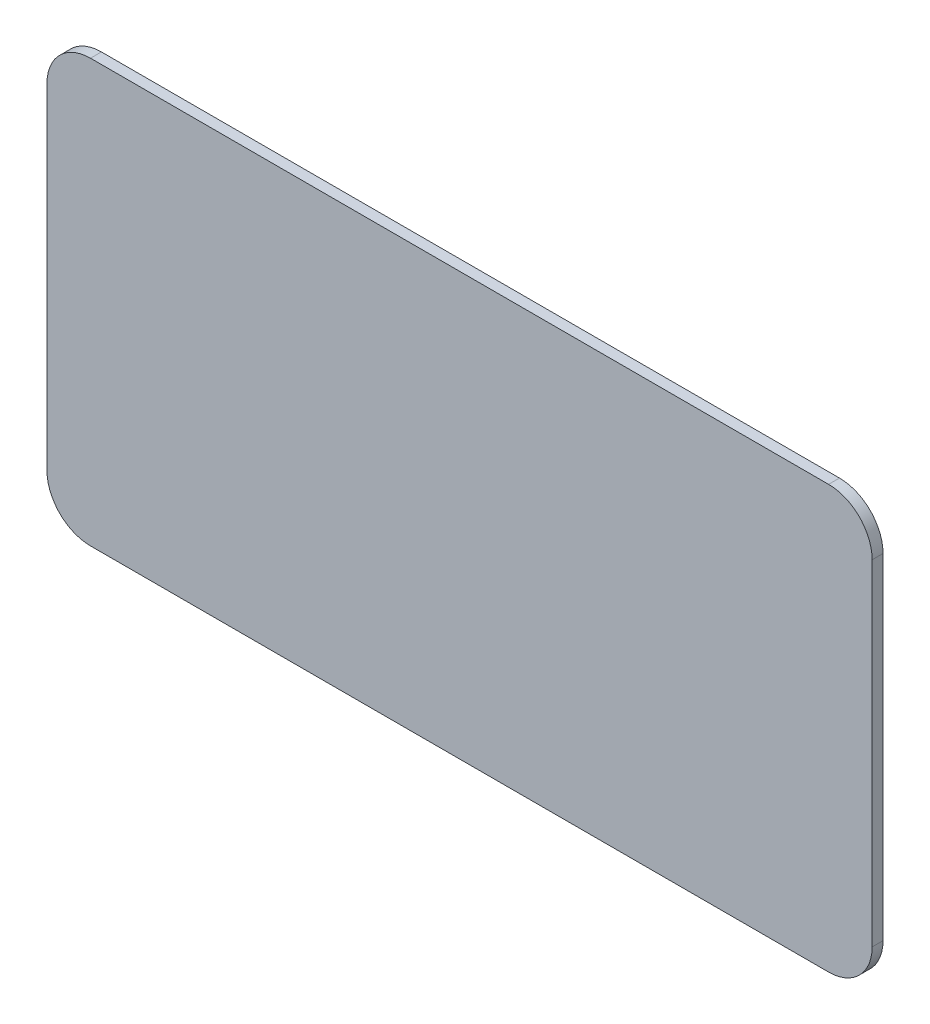
ISO-10303-21;
HEADER;
FILE_DESCRIPTION(('STEP AP214'),'2;1');
FILE_NAME('part.step','',(''),(''),'','','');
FILE_SCHEMA(('AUTOMOTIVE_DESIGN { 1 0 10303 214 1 1 1 1 }'));
ENDSEC;
DATA;
#1=APPLICATION_CONTEXT('core data for automotive mechanical design processes');
#2=APPLICATION_PROTOCOL_DEFINITION('international standard','automotive_design',2000,#1);
#3=PRODUCT_CONTEXT('',#1,'mechanical');
#4=PRODUCT('Part','Part','',(#3));
#5=PRODUCT_RELATED_PRODUCT_CATEGORY('part','',(#4));
#6=PRODUCT_DEFINITION_FORMATION('','',#4);
#7=PRODUCT_DEFINITION_CONTEXT('part definition',#1,'design');
#8=PRODUCT_DEFINITION('design','',#6,#7);
#9=PRODUCT_DEFINITION_SHAPE('','',#8);
#10=(LENGTH_UNIT() NAMED_UNIT(*) SI_UNIT(.MILLI.,.METRE.));
#11=(NAMED_UNIT(*) PLANE_ANGLE_UNIT() SI_UNIT($,.RADIAN.));
#12=(NAMED_UNIT(*) SI_UNIT($,.STERADIAN.) SOLID_ANGLE_UNIT());
#13=UNCERTAINTY_MEASURE_WITH_UNIT(LENGTH_MEASURE(1.E-05),#10,'distance_accuracy_value','');
#14=(GEOMETRIC_REPRESENTATION_CONTEXT(3) GLOBAL_UNCERTAINTY_ASSIGNED_CONTEXT((#13)) GLOBAL_UNIT_ASSIGNED_CONTEXT((#10,
#11,#12)) REPRESENTATION_CONTEXT('',''));
#15=CARTESIAN_POINT('',(0.,0.,0.));
#16=DIRECTION('',(0.,0.,1.));
#17=DIRECTION('',(1.,0.,0.));
#18=AXIS2_PLACEMENT_3D('',#15,#16,#17);
#19=CARTESIAN_POINT('',(0.,0.,10.));
#20=DIRECTION('',(1.,0.,0.));
#21=DIRECTION('',(0.,0.,-1.));
#22=AXIS2_PLACEMENT_3D('',#19,#20,#21);
#23=PLANE('',#22);
#24=DIRECTION('',(0.,-1.,0.));
#25=VECTOR('',#24,1.);
#26=CARTESIAN_POINT('',(0.,0.,10.));
#27=LINE('',#26,#25);
#28=CARTESIAN_POINT('',(0.,348.,10.));
#29=VERTEX_POINT('',#28);
#30=CARTESIAN_POINT('',(0.,40.,10.));
#31=VERTEX_POINT('',#30);
#32=EDGE_CURVE('E116',#29,#31,#27,.T.);
#33=ORIENTED_EDGE('',*,*,#32,.F.);
#34=DIRECTION('',(0.,0.,-1.));
#35=VECTOR('',#34,1.);
#36=CARTESIAN_POINT('',(0.,348.,10.));
#37=LINE('',#36,#35);
#38=CARTESIAN_POINT('',(0.,348.,0.));
#39=VERTEX_POINT('',#38);
#40=EDGE_CURVE('E150',#29,#39,#37,.T.);
#41=ORIENTED_EDGE('',*,*,#40,.T.);
#42=DIRECTION('',(0.,-1.,0.));
#43=VECTOR('',#42,1.);
#44=CARTESIAN_POINT('',(0.,0.,0.));
#45=LINE('',#44,#43);
#46=CARTESIAN_POINT('',(0.,40.,0.));
#47=VERTEX_POINT('',#46);
#48=EDGE_CURVE('E156',#39,#47,#45,.T.);
#49=ORIENTED_EDGE('',*,*,#48,.T.);
#50=DIRECTION('',(0.,0.,-1.));
#51=VECTOR('',#50,1.);
#52=CARTESIAN_POINT('',(0.,40.,10.));
#53=LINE('',#52,#51);
#54=EDGE_CURVE('E145',#47,#31,#53,.F.);
#55=ORIENTED_EDGE('',*,*,#54,.T.);
#56=EDGE_LOOP('',(#33,#41,#49,#55));
#57=FACE_BOUND('',#56,.T.);
#58=ADVANCED_FACE('F36',(#57),#23,.F.);
#59=CARTESIAN_POINT('',(0.,0.,10.));
#60=DIRECTION('',(0.,1.,0.));
#61=DIRECTION('',(0.,0.,1.));
#62=AXIS2_PLACEMENT_3D('',#59,#60,#61);
#63=PLANE('',#62);
#64=DIRECTION('',(1.,0.,0.));
#65=VECTOR('',#64,1.);
#66=CARTESIAN_POINT('',(0.,0.,10.));
#67=LINE('',#66,#65);
#68=CARTESIAN_POINT('',(40.,0.,10.));
#69=VERTEX_POINT('',#68);
#70=CARTESIAN_POINT('',(718.,0.,10.));
#71=VERTEX_POINT('',#70);
#72=EDGE_CURVE('E119',#69,#71,#67,.T.);
#73=ORIENTED_EDGE('',*,*,#72,.F.);
#74=DIRECTION('',(0.,0.,-1.));
#75=VECTOR('',#74,1.);
#76=CARTESIAN_POINT('',(40.,0.,10.));
#77=LINE('',#76,#75);
#78=CARTESIAN_POINT('',(40.,0.,0.));
#79=VERTEX_POINT('',#78);
#80=EDGE_CURVE('E139',#69,#79,#77,.T.);
#81=ORIENTED_EDGE('',*,*,#80,.T.);
#82=DIRECTION('',(1.,0.,0.));
#83=VECTOR('',#82,1.);
#84=CARTESIAN_POINT('',(0.,0.,0.));
#85=LINE('',#84,#83);
#86=CARTESIAN_POINT('',(718.,0.,0.));
#87=VERTEX_POINT('',#86);
#88=EDGE_CURVE('E121',#79,#87,#85,.T.);
#89=ORIENTED_EDGE('',*,*,#88,.T.);
#90=DIRECTION('',(0.,0.,-1.));
#91=VECTOR('',#90,1.);
#92=CARTESIAN_POINT('',(718.,0.,10.));
#93=LINE('',#92,#91);
#94=EDGE_CURVE('E134',#87,#71,#93,.F.);
#95=ORIENTED_EDGE('',*,*,#94,.T.);
#96=EDGE_LOOP('',(#73,#81,#89,#95));
#97=FACE_BOUND('',#96,.T.);
#98=ADVANCED_FACE('F175',(#97),#63,.F.);
#99=CARTESIAN_POINT('',(758.,0.,10.));
#100=DIRECTION('',(-1.,0.,0.));
#101=DIRECTION('',(0.,0.,1.));
#102=AXIS2_PLACEMENT_3D('',#99,#100,#101);
#103=PLANE('',#102);
#104=DIRECTION('',(0.,1.,0.));
#105=VECTOR('',#104,1.);
#106=CARTESIAN_POINT('',(758.,0.,10.));
#107=LINE('',#106,#105);
#108=CARTESIAN_POINT('',(758.,40.,10.));
#109=VERTEX_POINT('',#108);
#110=CARTESIAN_POINT('',(758.,348.,10.));
#111=VERTEX_POINT('',#110);
#112=EDGE_CURVE('E164',#109,#111,#107,.T.);
#113=ORIENTED_EDGE('',*,*,#112,.F.);
#114=DIRECTION('',(0.,0.,-1.));
#115=VECTOR('',#114,1.);
#116=CARTESIAN_POINT('',(758.,40.,10.));
#117=LINE('',#116,#115);
#118=CARTESIAN_POINT('',(758.,40.,0.));
#119=VERTEX_POINT('',#118);
#120=EDGE_CURVE('E128',#109,#119,#117,.T.);
#121=ORIENTED_EDGE('',*,*,#120,.T.);
#122=DIRECTION('',(0.,1.,0.));
#123=VECTOR('',#122,1.);
#124=CARTESIAN_POINT('',(758.,0.,0.));
#125=LINE('',#124,#123);
#126=CARTESIAN_POINT('',(758.,348.,0.));
#127=VERTEX_POINT('',#126);
#128=EDGE_CURVE('E117',#119,#127,#125,.T.);
#129=ORIENTED_EDGE('',*,*,#128,.T.);
#130=DIRECTION('',(0.,0.,-1.));
#131=VECTOR('',#130,1.);
#132=CARTESIAN_POINT('',(758.,348.,10.));
#133=LINE('',#132,#131);
#134=EDGE_CURVE('E108',#127,#111,#133,.F.);
#135=ORIENTED_EDGE('',*,*,#134,.T.);
#136=EDGE_LOOP('',(#113,#121,#129,#135));
#137=FACE_BOUND('',#136,.T.);
#138=ADVANCED_FACE('F180',(#137),#103,.F.);
#139=CARTESIAN_POINT('',(0.,388.,10.));
#140=DIRECTION('',(0.,-1.,0.));
#141=DIRECTION('',(0.,0.,-1.));
#142=AXIS2_PLACEMENT_3D('',#139,#140,#141);
#143=PLANE('',#142);
#144=DIRECTION('',(-1.,0.,0.));
#145=VECTOR('',#144,1.);
#146=CARTESIAN_POINT('',(0.,388.,0.));
#147=LINE('',#146,#145);
#148=CARTESIAN_POINT('',(718.,388.,0.));
#149=VERTEX_POINT('',#148);
#150=CARTESIAN_POINT('',(40.,388.,0.));
#151=VERTEX_POINT('',#150);
#152=EDGE_CURVE('E112',#149,#151,#147,.T.);
#153=ORIENTED_EDGE('',*,*,#152,.T.);
#154=DIRECTION('',(0.,0.,-1.));
#155=VECTOR('',#154,1.);
#156=CARTESIAN_POINT('',(40.,388.,10.));
#157=LINE('',#156,#155);
#158=CARTESIAN_POINT('',(40.,388.,10.));
#159=VERTEX_POINT('',#158);
#160=EDGE_CURVE('E44',#151,#159,#157,.F.);
#161=ORIENTED_EDGE('',*,*,#160,.T.);
#162=DIRECTION('',(-1.,0.,0.));
#163=VECTOR('',#162,1.);
#164=CARTESIAN_POINT('',(0.,388.,10.));
#165=LINE('',#164,#163);
#166=CARTESIAN_POINT('',(718.,388.,10.));
#167=VERTEX_POINT('',#166);
#168=EDGE_CURVE('E113',#167,#159,#165,.T.);
#169=ORIENTED_EDGE('',*,*,#168,.F.);
#170=DIRECTION('',(0.,0.,-1.));
#171=VECTOR('',#170,1.);
#172=CARTESIAN_POINT('',(718.,388.,10.));
#173=LINE('',#172,#171);
#174=EDGE_CURVE('E106',#167,#149,#173,.T.);
#175=ORIENTED_EDGE('',*,*,#174,.T.);
#176=EDGE_LOOP('',(#153,#161,#169,#175));
#177=FACE_BOUND('',#176,.T.);
#178=ADVANCED_FACE('F111',(#177),#143,.F.);
#179=CARTESIAN_POINT('',(0.,0.,10.));
#180=DIRECTION('',(0.,0.,-1.));
#181=DIRECTION('',(-1.,0.,0.));
#182=AXIS2_PLACEMENT_3D('',#179,#180,#181);
#183=PLANE('',#182);
#184=ORIENTED_EDGE('',*,*,#168,.T.);
#185=CARTESIAN_POINT('',(40.,348.,10.));
#186=DIRECTION('',(0.,0.,-1.));
#187=DIRECTION('',(-1.,0.,0.));
#188=AXIS2_PLACEMENT_3D('',#185,#186,#187);
#189=CIRCLE('',#188,40.);
#190=EDGE_CURVE('E11',#159,#29,#189,.F.);
#191=ORIENTED_EDGE('',*,*,#190,.T.);
#192=ORIENTED_EDGE('',*,*,#32,.T.);
#193=CARTESIAN_POINT('',(40.,40.,10.));
#194=DIRECTION('',(0.,0.,-1.));
#195=DIRECTION('',(-1.,0.,0.));
#196=AXIS2_PLACEMENT_3D('',#193,#194,#195);
#197=CIRCLE('',#196,40.);
#198=EDGE_CURVE('E148',#31,#69,#197,.F.);
#199=ORIENTED_EDGE('',*,*,#198,.T.);
#200=ORIENTED_EDGE('',*,*,#72,.T.);
#201=CARTESIAN_POINT('',(718.,40.,10.));
#202=DIRECTION('',(0.,0.,-1.));
#203=DIRECTION('',(-1.,0.,0.));
#204=AXIS2_PLACEMENT_3D('',#201,#202,#203);
#205=CIRCLE('',#204,40.);
#206=EDGE_CURVE('E137',#71,#109,#205,.F.);
#207=ORIENTED_EDGE('',*,*,#206,.T.);
#208=ORIENTED_EDGE('',*,*,#112,.T.);
#209=CARTESIAN_POINT('',(718.,348.,10.));
#210=DIRECTION('',(0.,0.,-1.));
#211=DIRECTION('',(-1.,0.,0.));
#212=AXIS2_PLACEMENT_3D('',#209,#210,#211);
#213=CIRCLE('',#212,40.);
#214=EDGE_CURVE('E126',#111,#167,#213,.F.);
#215=ORIENTED_EDGE('',*,*,#214,.T.);
#216=EDGE_LOOP('',(#184,#191,#192,#199,#200,#207,#208,#215));
#217=FACE_BOUND('',#216,.T.);
#218=ADVANCED_FACE('F168',(#217),#183,.F.);
#219=CARTESIAN_POINT('',(0.,0.,0.));
#220=DIRECTION('',(0.,0.,-1.));
#221=DIRECTION('',(-1.,0.,0.));
#222=AXIS2_PLACEMENT_3D('',#219,#220,#221);
#223=PLANE('',#222);
#224=ORIENTED_EDGE('',*,*,#48,.F.);
#225=CARTESIAN_POINT('',(40.,348.,0.));
#226=DIRECTION('',(0.,0.,-1.));
#227=DIRECTION('',(-1.,0.,0.));
#228=AXIS2_PLACEMENT_3D('',#225,#226,#227);
#229=CIRCLE('',#228,40.);
#230=EDGE_CURVE('E58',#39,#151,#229,.T.);
#231=ORIENTED_EDGE('',*,*,#230,.T.);
#232=ORIENTED_EDGE('',*,*,#152,.F.);
#233=CARTESIAN_POINT('',(718.,348.,0.));
#234=DIRECTION('',(0.,0.,-1.));
#235=DIRECTION('',(-1.,0.,0.));
#236=AXIS2_PLACEMENT_3D('',#233,#234,#235);
#237=CIRCLE('',#236,40.);
#238=EDGE_CURVE('E102',#149,#127,#237,.T.);
#239=ORIENTED_EDGE('',*,*,#238,.T.);
#240=ORIENTED_EDGE('',*,*,#128,.F.);
#241=CARTESIAN_POINT('',(718.,40.,0.));
#242=DIRECTION('',(0.,0.,-1.));
#243=DIRECTION('',(-1.,0.,0.));
#244=AXIS2_PLACEMENT_3D('',#241,#242,#243);
#245=CIRCLE('',#244,40.);
#246=EDGE_CURVE('E131',#119,#87,#245,.T.);
#247=ORIENTED_EDGE('',*,*,#246,.T.);
#248=ORIENTED_EDGE('',*,*,#88,.F.);
#249=CARTESIAN_POINT('',(40.,40.,0.));
#250=DIRECTION('',(0.,0.,-1.));
#251=DIRECTION('',(-1.,0.,0.));
#252=AXIS2_PLACEMENT_3D('',#249,#250,#251);
#253=CIRCLE('',#252,40.);
#254=EDGE_CURVE('E142',#79,#47,#253,.T.);
#255=ORIENTED_EDGE('',*,*,#254,.T.);
#256=EDGE_LOOP('',(#224,#231,#232,#239,#240,#247,#248,#255));
#257=FACE_BOUND('',#256,.T.);
#258=ADVANCED_FACE('F115',(#257),#223,.T.);
#259=CARTESIAN_POINT('',(718.,348.,10.));
#260=DIRECTION('',(0.,0.,-1.));
#261=DIRECTION('',(-1.,0.,0.));
#262=AXIS2_PLACEMENT_3D('',#259,#260,#261);
#263=CYLINDRICAL_SURFACE('',#262,40.);
#264=ORIENTED_EDGE('',*,*,#214,.F.);
#265=ORIENTED_EDGE('',*,*,#134,.F.);
#266=ORIENTED_EDGE('',*,*,#238,.F.);
#267=ORIENTED_EDGE('',*,*,#174,.F.);
#268=EDGE_LOOP('',(#264,#265,#266,#267));
#269=FACE_BOUND('',#268,.T.);
#270=ADVANCED_FACE('F105',(#269),#263,.T.);
#271=CARTESIAN_POINT('',(718.,40.,10.));
#272=DIRECTION('',(0.,0.,-1.));
#273=DIRECTION('',(-1.,0.,0.));
#274=AXIS2_PLACEMENT_3D('',#271,#272,#273);
#275=CYLINDRICAL_SURFACE('',#274,40.);
#276=ORIENTED_EDGE('',*,*,#206,.F.);
#277=ORIENTED_EDGE('',*,*,#94,.F.);
#278=ORIENTED_EDGE('',*,*,#246,.F.);
#279=ORIENTED_EDGE('',*,*,#120,.F.);
#280=EDGE_LOOP('',(#276,#277,#278,#279));
#281=FACE_BOUND('',#280,.T.);
#282=ADVANCED_FACE('F178',(#281),#275,.T.);
#283=CARTESIAN_POINT('',(40.,40.,10.));
#284=DIRECTION('',(0.,0.,-1.));
#285=DIRECTION('',(-1.,0.,0.));
#286=AXIS2_PLACEMENT_3D('',#283,#284,#285);
#287=CYLINDRICAL_SURFACE('',#286,40.);
#288=ORIENTED_EDGE('',*,*,#198,.F.);
#289=ORIENTED_EDGE('',*,*,#54,.F.);
#290=ORIENTED_EDGE('',*,*,#254,.F.);
#291=ORIENTED_EDGE('',*,*,#80,.F.);
#292=EDGE_LOOP('',(#288,#289,#290,#291));
#293=FACE_BOUND('',#292,.T.);
#294=ADVANCED_FACE('F182',(#293),#287,.T.);
#295=CARTESIAN_POINT('',(40.,348.,10.));
#296=DIRECTION('',(0.,0.,-1.));
#297=DIRECTION('',(-1.,0.,0.));
#298=AXIS2_PLACEMENT_3D('',#295,#296,#297);
#299=CYLINDRICAL_SURFACE('',#298,40.);
#300=ORIENTED_EDGE('',*,*,#190,.F.);
#301=ORIENTED_EDGE('',*,*,#160,.F.);
#302=ORIENTED_EDGE('',*,*,#230,.F.);
#303=ORIENTED_EDGE('',*,*,#40,.F.);
#304=EDGE_LOOP('',(#300,#301,#302,#303));
#305=FACE_BOUND('',#304,.T.);
#306=ADVANCED_FACE('F38',(#305),#299,.T.);
#307=CLOSED_SHELL('',(#58,#98,#138,#178,#218,#258,#270,#282,#294,#306));
#308=MANIFOLD_SOLID_BREP('B2',#307);
#309=ADVANCED_BREP_SHAPE_REPRESENTATION('',(#18,#308),#14);
#310=SHAPE_DEFINITION_REPRESENTATION(#9,#309);
ENDSEC;
END-ISO-10303-21;
